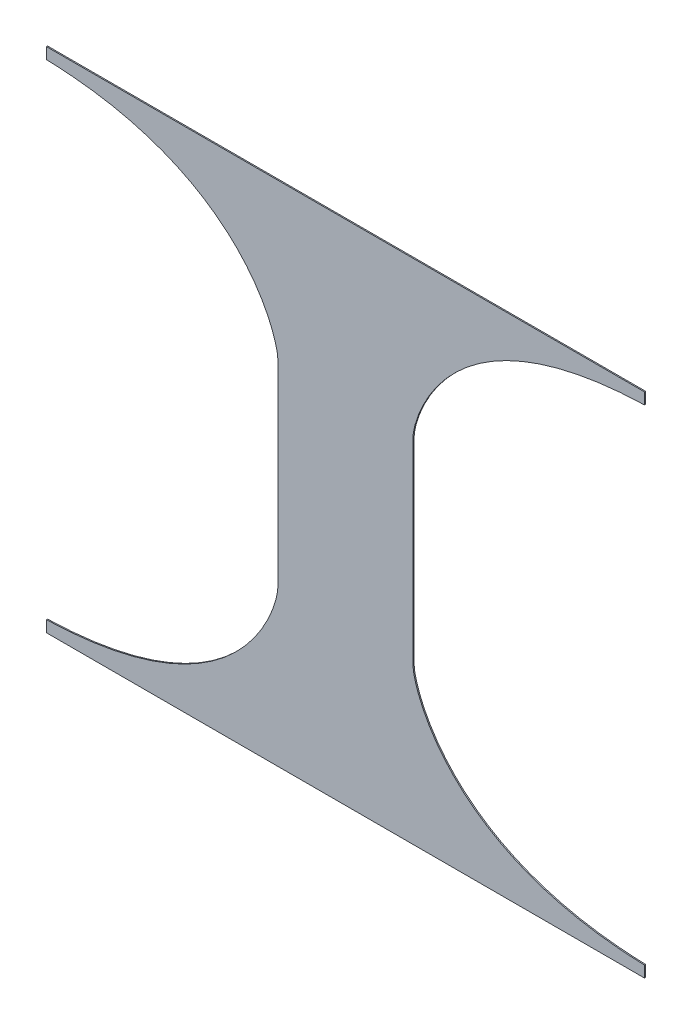
ISO-10303-21;
HEADER;
FILE_DESCRIPTION(('STEP AP214'),'2;1');
FILE_NAME('part.step','',(''),(''),'','','');
FILE_SCHEMA(('AUTOMOTIVE_DESIGN { 1 0 10303 214 1 1 1 1 }'));
ENDSEC;
DATA;
#1=APPLICATION_CONTEXT('core data for automotive mechanical design processes');
#2=APPLICATION_PROTOCOL_DEFINITION('international standard','automotive_design',2000,#1);
#3=PRODUCT_CONTEXT('',#1,'mechanical');
#4=PRODUCT('Part','Part','',(#3));
#5=PRODUCT_RELATED_PRODUCT_CATEGORY('part','',(#4));
#6=PRODUCT_DEFINITION_FORMATION('','',#4);
#7=PRODUCT_DEFINITION_CONTEXT('part definition',#1,'design');
#8=PRODUCT_DEFINITION('design','',#6,#7);
#9=PRODUCT_DEFINITION_SHAPE('','',#8);
#10=(LENGTH_UNIT() NAMED_UNIT(*) SI_UNIT(.MILLI.,.METRE.));
#11=(NAMED_UNIT(*) PLANE_ANGLE_UNIT() SI_UNIT($,.RADIAN.));
#12=(NAMED_UNIT(*) SI_UNIT($,.STERADIAN.) SOLID_ANGLE_UNIT());
#13=UNCERTAINTY_MEASURE_WITH_UNIT(LENGTH_MEASURE(1.E-05),#10,'distance_accuracy_value','');
#14=(GEOMETRIC_REPRESENTATION_CONTEXT(3) GLOBAL_UNCERTAINTY_ASSIGNED_CONTEXT((#13)) GLOBAL_UNIT_ASSIGNED_CONTEXT((#10,
#11,#12)) REPRESENTATION_CONTEXT('',''));
#15=CARTESIAN_POINT('',(0.,0.,0.));
#16=DIRECTION('',(0.,0.,1.));
#17=DIRECTION('',(1.,0.,0.));
#18=AXIS2_PLACEMENT_3D('',#15,#16,#17);
#19=CARTESIAN_POINT('',(673.1,-571.5,1.27));
#20=DIRECTION('',(-1.,0.,0.));
#21=DIRECTION('',(0.,0.,1.));
#22=AXIS2_PLACEMENT_3D('',#19,#20,#21);
#23=PLANE('',#22);
#24=DIRECTION('',(0.,1.,0.));
#25=VECTOR('',#24,1.);
#26=CARTESIAN_POINT('',(673.1,-571.5,1.27));
#27=LINE('',#26,#25);
#28=CARTESIAN_POINT('',(673.1,546.1,1.27));
#29=VERTEX_POINT('',#28);
#30=CARTESIAN_POINT('',(673.1,571.5,1.27));
#31=VERTEX_POINT('',#30);
#32=EDGE_CURVE('E148',#29,#31,#27,.T.);
#33=ORIENTED_EDGE('',*,*,#32,.F.);
#34=DIRECTION('',(0.,0.,1.));
#35=VECTOR('',#34,1.);
#36=CARTESIAN_POINT('',(673.1,546.1,-1.27));
#37=LINE('',#36,#35);
#38=CARTESIAN_POINT('',(673.1,546.1,-1.27));
#39=VERTEX_POINT('',#38);
#40=EDGE_CURVE('E193',#39,#29,#37,.T.);
#41=ORIENTED_EDGE('',*,*,#40,.F.);
#42=DIRECTION('',(0.,1.,0.));
#43=VECTOR('',#42,1.);
#44=CARTESIAN_POINT('',(673.1,-571.5,-1.27));
#45=LINE('',#44,#43);
#46=CARTESIAN_POINT('',(673.1,571.5,-1.27));
#47=VERTEX_POINT('',#46);
#48=EDGE_CURVE('E175',#39,#47,#45,.T.);
#49=ORIENTED_EDGE('',*,*,#48,.T.);
#50=DIRECTION('',(0.,0.,-1.));
#51=VECTOR('',#50,1.);
#52=CARTESIAN_POINT('',(673.1,571.5,1.27));
#53=LINE('',#52,#51);
#54=EDGE_CURVE('E11',#31,#47,#53,.T.);
#55=ORIENTED_EDGE('',*,*,#54,.F.);
#56=EDGE_LOOP('',(#33,#41,#49,#55));
#57=FACE_BOUND('',#56,.T.);
#58=ADVANCED_FACE('F32',(#57),#23,.F.);
#59=CARTESIAN_POINT('',(-673.1,-571.5,1.27));
#60=DIRECTION('',(1.,0.,0.));
#61=DIRECTION('',(0.,0.,-1.));
#62=AXIS2_PLACEMENT_3D('',#59,#60,#61);
#63=PLANE('',#62);
#64=DIRECTION('',(0.,-1.,0.));
#65=VECTOR('',#64,1.);
#66=CARTESIAN_POINT('',(-673.1,-571.5,-1.27));
#67=LINE('',#66,#65);
#68=CARTESIAN_POINT('',(-673.1,571.5,-1.27));
#69=VERTEX_POINT('',#68);
#70=CARTESIAN_POINT('',(-673.1,546.1,-1.27));
#71=VERTEX_POINT('',#70);
#72=EDGE_CURVE('E137',#69,#71,#67,.T.);
#73=ORIENTED_EDGE('',*,*,#72,.T.);
#74=DIRECTION('',(0.,0.,1.));
#75=VECTOR('',#74,1.);
#76=CARTESIAN_POINT('',(-673.1,546.1,-1.27));
#77=LINE('',#76,#75);
#78=CARTESIAN_POINT('',(-673.1,546.1,1.27));
#79=VERTEX_POINT('',#78);
#80=EDGE_CURVE('E121',#71,#79,#77,.T.);
#81=ORIENTED_EDGE('',*,*,#80,.T.);
#82=DIRECTION('',(0.,-1.,0.));
#83=VECTOR('',#82,1.);
#84=CARTESIAN_POINT('',(-673.1,-571.5,1.27));
#85=LINE('',#84,#83);
#86=CARTESIAN_POINT('',(-673.1,571.5,1.27));
#87=VERTEX_POINT('',#86);
#88=EDGE_CURVE('E179',#87,#79,#85,.T.);
#89=ORIENTED_EDGE('',*,*,#88,.F.);
#90=DIRECTION('',(0.,0.,-1.));
#91=VECTOR('',#90,1.);
#92=CARTESIAN_POINT('',(-673.1,571.5,1.27));
#93=LINE('',#92,#91);
#94=EDGE_CURVE('E40',#87,#69,#93,.T.);
#95=ORIENTED_EDGE('',*,*,#94,.T.);
#96=EDGE_LOOP('',(#73,#81,#89,#95));
#97=FACE_BOUND('',#96,.T.);
#98=ADVANCED_FACE('F143',(#97),#63,.F.);
#99=CARTESIAN_POINT('',(673.1,-571.5,-1.27));
#100=VERTEX_POINT('',#99);
#101=CARTESIAN_POINT('',(673.1,-546.1,-1.27));
#102=VERTEX_POINT('',#101);
#103=EDGE_CURVE('E171',#100,#102,#45,.T.);
#104=ORIENTED_EDGE('',*,*,#103,.T.);
#105=DIRECTION('',(0.,0.,1.));
#106=VECTOR('',#105,1.);
#107=CARTESIAN_POINT('',(673.1,-546.1,-1.27));
#108=LINE('',#107,#106);
#109=CARTESIAN_POINT('',(673.1,-546.1,1.27));
#110=VERTEX_POINT('',#109);
#111=EDGE_CURVE('E191',#102,#110,#108,.T.);
#112=ORIENTED_EDGE('',*,*,#111,.T.);
#113=CARTESIAN_POINT('',(673.1,-571.5,1.27));
#114=VERTEX_POINT('',#113);
#115=EDGE_CURVE('E184',#114,#110,#27,.T.);
#116=ORIENTED_EDGE('',*,*,#115,.F.);
#117=DIRECTION('',(0.,0.,-1.));
#118=VECTOR('',#117,1.);
#119=CARTESIAN_POINT('',(673.1,-571.5,1.27));
#120=LINE('',#119,#118);
#121=EDGE_CURVE('E154',#114,#100,#120,.T.);
#122=ORIENTED_EDGE('',*,*,#121,.T.);
#123=EDGE_LOOP('',(#104,#112,#116,#122));
#124=FACE_BOUND('',#123,.T.);
#125=ADVANCED_FACE('F34',(#124),#23,.F.);
#126=CARTESIAN_POINT('',(-673.1,571.5,1.27));
#127=DIRECTION('',(0.,-1.,0.));
#128=DIRECTION('',(0.,0.,-1.));
#129=AXIS2_PLACEMENT_3D('',#126,#127,#128);
#130=PLANE('',#129);
#131=DIRECTION('',(-1.,0.,0.));
#132=VECTOR('',#131,1.);
#133=CARTESIAN_POINT('',(-673.1,571.5,-1.27));
#134=LINE('',#133,#132);
#135=EDGE_CURVE('E150',#47,#69,#134,.T.);
#136=ORIENTED_EDGE('',*,*,#135,.T.);
#137=ORIENTED_EDGE('',*,*,#94,.F.);
#138=DIRECTION('',(-1.,0.,0.));
#139=VECTOR('',#138,1.);
#140=CARTESIAN_POINT('',(-673.1,571.5,1.27));
#141=LINE('',#140,#139);
#142=EDGE_CURVE('E182',#31,#87,#141,.T.);
#143=ORIENTED_EDGE('',*,*,#142,.F.);
#144=ORIENTED_EDGE('',*,*,#54,.T.);
#145=EDGE_LOOP('',(#136,#137,#143,#144));
#146=FACE_BOUND('',#145,.T.);
#147=ADVANCED_FACE('F295',(#146),#130,.F.);
#148=CARTESIAN_POINT('',(-673.1,-546.1,1.27));
#149=VERTEX_POINT('',#148);
#150=CARTESIAN_POINT('',(-673.1,-571.5,1.27));
#151=VERTEX_POINT('',#150);
#152=EDGE_CURVE('E181',#149,#151,#85,.T.);
#153=ORIENTED_EDGE('',*,*,#152,.F.);
#154=DIRECTION('',(0.,0.,1.));
#155=VECTOR('',#154,1.);
#156=CARTESIAN_POINT('',(-673.1,-546.1,-1.27));
#157=LINE('',#156,#155);
#158=CARTESIAN_POINT('',(-673.1,-546.1,-1.27));
#159=VERTEX_POINT('',#158);
#160=EDGE_CURVE('E131',#159,#149,#157,.T.);
#161=ORIENTED_EDGE('',*,*,#160,.F.);
#162=CARTESIAN_POINT('',(-673.1,-571.5,-1.27));
#163=VERTEX_POINT('',#162);
#164=EDGE_CURVE('E146',#159,#163,#67,.T.);
#165=ORIENTED_EDGE('',*,*,#164,.T.);
#166=DIRECTION('',(0.,0.,-1.));
#167=VECTOR('',#166,1.);
#168=CARTESIAN_POINT('',(-673.1,-571.5,1.27));
#169=LINE('',#168,#167);
#170=EDGE_CURVE('E157',#151,#163,#169,.T.);
#171=ORIENTED_EDGE('',*,*,#170,.F.);
#172=EDGE_LOOP('',(#153,#161,#165,#171));
#173=FACE_BOUND('',#172,.T.);
#174=ADVANCED_FACE('F292',(#173),#63,.F.);
#175=CARTESIAN_POINT('',(-673.1,-571.5,1.27));
#176=DIRECTION('',(0.,1.,0.));
#177=DIRECTION('',(0.,0.,1.));
#178=AXIS2_PLACEMENT_3D('',#175,#176,#177);
#179=PLANE('',#178);
#180=DIRECTION('',(1.,0.,0.));
#181=VECTOR('',#180,1.);
#182=CARTESIAN_POINT('',(-673.1,-571.5,-1.27));
#183=LINE('',#182,#181);
#184=EDGE_CURVE('E145',#163,#100,#183,.T.);
#185=ORIENTED_EDGE('',*,*,#184,.T.);
#186=ORIENTED_EDGE('',*,*,#121,.F.);
#187=DIRECTION('',(1.,0.,0.));
#188=VECTOR('',#187,1.);
#189=CARTESIAN_POINT('',(-673.1,-571.5,1.27));
#190=LINE('',#189,#188);
#191=EDGE_CURVE('E158',#151,#114,#190,.T.);
#192=ORIENTED_EDGE('',*,*,#191,.F.);
#193=ORIENTED_EDGE('',*,*,#170,.T.);
#194=EDGE_LOOP('',(#185,#186,#192,#193));
#195=FACE_BOUND('',#194,.T.);
#196=ADVANCED_FACE('F164',(#195),#179,.F.);
#197=CARTESIAN_POINT('',(0.,0.,1.27));
#198=DIRECTION('',(0.,0.,-1.));
#199=DIRECTION('',(-1.,0.,0.));
#200=AXIS2_PLACEMENT_3D('',#197,#198,#199);
#201=PLANE('',#200);
#202=ORIENTED_EDGE('',*,*,#88,.T.);
#203=CARTESIAN_POINT('',(-152.4,224.495117072886,1.27));
#204=CARTESIAN_POINT('',(-152.400000000002,258.704669828593,1.27));
#205=CARTESIAN_POINT('',(-224.053162496935,532.777731837791,1.27));
#206=CARTESIAN_POINT('',(-673.1,546.1,1.27));
#207=B_SPLINE_CURVE_WITH_KNOTS('',3,(#203,#204,#205,#206),.UNSPECIFIED.,.F.,.F.,(4,4),(0.,1.),.UNSPECIFIED.);
#208=CARTESIAN_POINT('',(-152.4,224.495117072886,1.27));
#209=VERTEX_POINT('',#208);
#210=EDGE_CURVE('E126',#209,#79,#207,.T.);
#211=ORIENTED_EDGE('',*,*,#210,.F.);
#212=DIRECTION('',(0.,1.,0.));
#213=VECTOR('',#212,1.);
#214=CARTESIAN_POINT('',(-152.4,224.495117072886,1.27));
#215=LINE('',#214,#213);
#216=CARTESIAN_POINT('',(-152.4,-224.495117072886,1.27));
#217=VERTEX_POINT('',#216);
#218=EDGE_CURVE('E140',#217,#209,#215,.T.);
#219=ORIENTED_EDGE('',*,*,#218,.F.);
#220=CARTESIAN_POINT('',(-673.1,-546.1,1.27));
#221=CARTESIAN_POINT('',(-224.053162496935,-532.777731837791,1.27));
#222=CARTESIAN_POINT('',(-152.400000000002,-258.704669828593,1.27));
#223=CARTESIAN_POINT('',(-152.4,-224.495117072886,1.27));
#224=B_SPLINE_CURVE_WITH_KNOTS('',3,(#220,#221,#222,#223),.UNSPECIFIED.,.F.,.F.,(4,4),(0.,1.),.UNSPECIFIED.);
#225=EDGE_CURVE('E253',#149,#217,#224,.T.);
#226=ORIENTED_EDGE('',*,*,#225,.F.);
#227=ORIENTED_EDGE('',*,*,#152,.T.);
#228=ORIENTED_EDGE('',*,*,#191,.T.);
#229=ORIENTED_EDGE('',*,*,#115,.T.);
#230=CARTESIAN_POINT('',(152.4,-224.495117072886,1.27));
#231=CARTESIAN_POINT('',(152.400000000002,-258.704669828593,1.27));
#232=CARTESIAN_POINT('',(224.053162496935,-532.777731837791,1.27));
#233=CARTESIAN_POINT('',(673.1,-546.1,1.27));
#234=B_SPLINE_CURVE_WITH_KNOTS('',3,(#230,#231,#232,#233),.UNSPECIFIED.,.F.,.F.,(4,4),(0.,1.),.UNSPECIFIED.);
#235=CARTESIAN_POINT('',(152.4,-224.495117072886,1.27));
#236=VERTEX_POINT('',#235);
#237=EDGE_CURVE('E195',#236,#110,#234,.T.);
#238=ORIENTED_EDGE('',*,*,#237,.F.);
#239=DIRECTION('',(0.,-1.,0.));
#240=VECTOR('',#239,1.);
#241=CARTESIAN_POINT('',(152.4,224.495117072886,1.27));
#242=LINE('',#241,#240);
#243=CARTESIAN_POINT('',(152.4,224.495117072886,1.27));
#244=VERTEX_POINT('',#243);
#245=EDGE_CURVE('E200',#244,#236,#242,.T.);
#246=ORIENTED_EDGE('',*,*,#245,.F.);
#247=CARTESIAN_POINT('',(673.1,546.1,1.27));
#248=CARTESIAN_POINT('',(224.053162496935,532.777731837791,1.27));
#249=CARTESIAN_POINT('',(152.400000000002,258.704669828593,1.27));
#250=CARTESIAN_POINT('',(152.4,224.495117072886,1.27));
#251=B_SPLINE_CURVE_WITH_KNOTS('',3,(#247,#248,#249,#250),.UNSPECIFIED.,.F.,.F.,(4,4),(0.,1.),.UNSPECIFIED.);
#252=EDGE_CURVE('E206',#29,#244,#251,.T.);
#253=ORIENTED_EDGE('',*,*,#252,.F.);
#254=ORIENTED_EDGE('',*,*,#32,.T.);
#255=ORIENTED_EDGE('',*,*,#142,.T.);
#256=EDGE_LOOP('',(#202,#211,#219,#226,#227,#228,#229,#238,#246,#253,#254,#255));
#257=FACE_BOUND('',#256,.T.);
#258=ADVANCED_FACE('F237',(#257),#201,.F.);
#259=CARTESIAN_POINT('',(0.,0.,-1.27));
#260=DIRECTION('',(0.,0.,-1.));
#261=DIRECTION('',(-1.,0.,0.));
#262=AXIS2_PLACEMENT_3D('',#259,#260,#261);
#263=PLANE('',#262);
#264=CARTESIAN_POINT('',(-152.4,224.495117072886,-1.27));
#265=CARTESIAN_POINT('',(-152.400000000002,258.704669828593,-1.27));
#266=CARTESIAN_POINT('',(-224.053162496935,532.777731837791,-1.27));
#267=CARTESIAN_POINT('',(-673.1,546.1,-1.27));
#268=B_SPLINE_CURVE_WITH_KNOTS('',3,(#264,#265,#266,#267),.UNSPECIFIED.,.F.,.F.,(4,4),(0.,1.),.UNSPECIFIED.);
#269=CARTESIAN_POINT('',(-152.4,224.495117072886,-1.27));
#270=VERTEX_POINT('',#269);
#271=EDGE_CURVE('E124',#270,#71,#268,.T.);
#272=ORIENTED_EDGE('',*,*,#271,.T.);
#273=ORIENTED_EDGE('',*,*,#72,.F.);
#274=ORIENTED_EDGE('',*,*,#135,.F.);
#275=ORIENTED_EDGE('',*,*,#48,.F.);
#276=CARTESIAN_POINT('',(673.1,546.1,-1.27));
#277=CARTESIAN_POINT('',(224.053162496935,532.777731837791,-1.27));
#278=CARTESIAN_POINT('',(152.400000000002,258.704669828593,-1.27));
#279=CARTESIAN_POINT('',(152.4,224.495117072886,-1.27));
#280=B_SPLINE_CURVE_WITH_KNOTS('',3,(#276,#277,#278,#279),.UNSPECIFIED.,.F.,.F.,(4,4),(0.,1.),.UNSPECIFIED.);
#281=CARTESIAN_POINT('',(152.4,224.495117072886,-1.27));
#282=VERTEX_POINT('',#281);
#283=EDGE_CURVE('E199',#39,#282,#280,.T.);
#284=ORIENTED_EDGE('',*,*,#283,.T.);
#285=DIRECTION('',(0.,-1.,0.));
#286=VECTOR('',#285,1.);
#287=CARTESIAN_POINT('',(152.4,224.495117072886,-1.27));
#288=LINE('',#287,#286);
#289=CARTESIAN_POINT('',(152.4,-224.495117072886,-1.27));
#290=VERTEX_POINT('',#289);
#291=EDGE_CURVE('E218',#282,#290,#288,.T.);
#292=ORIENTED_EDGE('',*,*,#291,.T.);
#293=CARTESIAN_POINT('',(152.4,-224.495117072886,-1.27));
#294=CARTESIAN_POINT('',(152.400000000002,-258.704669828593,-1.27));
#295=CARTESIAN_POINT('',(224.053162496935,-532.777731837791,-1.27));
#296=CARTESIAN_POINT('',(673.1,-546.1,-1.27));
#297=B_SPLINE_CURVE_WITH_KNOTS('',3,(#293,#294,#295,#296),.UNSPECIFIED.,.F.,.F.,(4,4),(0.,1.),.UNSPECIFIED.);
#298=EDGE_CURVE('E55',#290,#102,#297,.T.);
#299=ORIENTED_EDGE('',*,*,#298,.T.);
#300=ORIENTED_EDGE('',*,*,#103,.F.);
#301=ORIENTED_EDGE('',*,*,#184,.F.);
#302=ORIENTED_EDGE('',*,*,#164,.F.);
#303=CARTESIAN_POINT('',(-673.1,-546.1,-1.27));
#304=CARTESIAN_POINT('',(-224.053162496935,-532.777731837791,-1.27));
#305=CARTESIAN_POINT('',(-152.400000000002,-258.704669828593,-1.27));
#306=CARTESIAN_POINT('',(-152.4,-224.495117072886,-1.27));
#307=B_SPLINE_CURVE_WITH_KNOTS('',3,(#303,#304,#305,#306),.UNSPECIFIED.,.F.,.F.,(4,4),(0.,1.),.UNSPECIFIED.);
#308=CARTESIAN_POINT('',(-152.4,-224.495117072886,-1.27));
#309=VERTEX_POINT('',#308);
#310=EDGE_CURVE('E139',#159,#309,#307,.T.);
#311=ORIENTED_EDGE('',*,*,#310,.T.);
#312=DIRECTION('',(0.,1.,0.));
#313=VECTOR('',#312,1.);
#314=CARTESIAN_POINT('',(-152.4,224.495117072886,-1.27));
#315=LINE('',#314,#313);
#316=EDGE_CURVE('E47',#309,#270,#315,.T.);
#317=ORIENTED_EDGE('',*,*,#316,.T.);
#318=EDGE_LOOP('',(#272,#273,#274,#275,#284,#292,#299,#300,#301,#302,#311,#317));
#319=FACE_BOUND('',#318,.T.);
#320=ADVANCED_FACE('F135',(#319),#263,.T.);
#321=DIRECTION('',(0.,0.,1.));
#322=VECTOR('',#321,1.);
#323=SURFACE_OF_LINEAR_EXTRUSION('',#280,#322);
#324=ORIENTED_EDGE('',*,*,#252,.T.);
#325=DIRECTION('',(0.,0.,1.));
#326=VECTOR('',#325,1.);
#327=CARTESIAN_POINT('',(152.4,224.495117072886,-1.27));
#328=LINE('',#327,#326);
#329=EDGE_CURVE('E187',#282,#244,#328,.T.);
#330=ORIENTED_EDGE('',*,*,#329,.F.);
#331=ORIENTED_EDGE('',*,*,#283,.F.);
#332=ORIENTED_EDGE('',*,*,#40,.T.);
#333=EDGE_LOOP('',(#324,#330,#331,#332));
#334=FACE_BOUND('',#333,.T.);
#335=ADVANCED_FACE('F229',(#334),#323,.F.);
#336=DIRECTION('',(0.,0.,1.));
#337=VECTOR('',#336,1.);
#338=SURFACE_OF_LINEAR_EXTRUSION('',#297,#337);
#339=ORIENTED_EDGE('',*,*,#237,.T.);
#340=ORIENTED_EDGE('',*,*,#111,.F.);
#341=ORIENTED_EDGE('',*,*,#298,.F.);
#342=DIRECTION('',(0.,0.,1.));
#343=VECTOR('',#342,1.);
#344=CARTESIAN_POINT('',(152.4,-224.495117072886,-1.27));
#345=LINE('',#344,#343);
#346=EDGE_CURVE('E189',#290,#236,#345,.T.);
#347=ORIENTED_EDGE('',*,*,#346,.T.);
#348=EDGE_LOOP('',(#339,#340,#341,#347));
#349=FACE_BOUND('',#348,.T.);
#350=ADVANCED_FACE('F224',(#349),#338,.F.);
#351=CARTESIAN_POINT('',(152.4,224.495117072886,-1.27));
#352=DIRECTION('',(-1.,0.,0.));
#353=DIRECTION('',(0.,0.,1.));
#354=AXIS2_PLACEMENT_3D('',#351,#352,#353);
#355=PLANE('',#354);
#356=ORIENTED_EDGE('',*,*,#245,.T.);
#357=ORIENTED_EDGE('',*,*,#346,.F.);
#358=ORIENTED_EDGE('',*,*,#291,.F.);
#359=ORIENTED_EDGE('',*,*,#329,.T.);
#360=EDGE_LOOP('',(#356,#357,#358,#359));
#361=FACE_BOUND('',#360,.T.);
#362=ADVANCED_FACE('F228',(#361),#355,.F.);
#363=DIRECTION('',(0.,0.,1.));
#364=VECTOR('',#363,1.);
#365=SURFACE_OF_LINEAR_EXTRUSION('',#268,#364);
#366=ORIENTED_EDGE('',*,*,#210,.T.);
#367=ORIENTED_EDGE('',*,*,#80,.F.);
#368=ORIENTED_EDGE('',*,*,#271,.F.);
#369=DIRECTION('',(0.,0.,1.));
#370=VECTOR('',#369,1.);
#371=CARTESIAN_POINT('',(-152.4,224.495117072886,-1.27));
#372=LINE('',#371,#370);
#373=EDGE_CURVE('E176',#270,#209,#372,.T.);
#374=ORIENTED_EDGE('',*,*,#373,.T.);
#375=EDGE_LOOP('',(#366,#367,#368,#374));
#376=FACE_BOUND('',#375,.T.);
#377=ADVANCED_FACE('F123',(#376),#365,.F.);
#378=CARTESIAN_POINT('',(-152.4,224.495117072886,-1.27));
#379=DIRECTION('',(1.,0.,0.));
#380=DIRECTION('',(0.,0.,-1.));
#381=AXIS2_PLACEMENT_3D('',#378,#379,#380);
#382=PLANE('',#381);
#383=ORIENTED_EDGE('',*,*,#218,.T.);
#384=ORIENTED_EDGE('',*,*,#373,.F.);
#385=ORIENTED_EDGE('',*,*,#316,.F.);
#386=DIRECTION('',(0.,0.,1.));
#387=VECTOR('',#386,1.);
#388=CARTESIAN_POINT('',(-152.4,-224.495117072886,-1.27));
#389=LINE('',#388,#387);
#390=EDGE_CURVE('E248',#309,#217,#389,.T.);
#391=ORIENTED_EDGE('',*,*,#390,.T.);
#392=EDGE_LOOP('',(#383,#384,#385,#391));
#393=FACE_BOUND('',#392,.T.);
#394=ADVANCED_FACE('F280',(#393),#382,.F.);
#395=DIRECTION('',(0.,0.,1.));
#396=VECTOR('',#395,1.);
#397=SURFACE_OF_LINEAR_EXTRUSION('',#307,#396);
#398=ORIENTED_EDGE('',*,*,#225,.T.);
#399=ORIENTED_EDGE('',*,*,#390,.F.);
#400=ORIENTED_EDGE('',*,*,#310,.F.);
#401=ORIENTED_EDGE('',*,*,#160,.T.);
#402=EDGE_LOOP('',(#398,#399,#400,#401));
#403=FACE_BOUND('',#402,.T.);
#404=ADVANCED_FACE('F277',(#403),#397,.F.);
#405=CLOSED_SHELL('',(#58,#98,#125,#147,#174,#196,#258,#320,#335,#350,#362,#377,#394,#404));
#406=MANIFOLD_SOLID_BREP('B2',#405);
#407=ADVANCED_BREP_SHAPE_REPRESENTATION('',(#18,#406),#14);
#408=SHAPE_DEFINITION_REPRESENTATION(#9,#407);
ENDSEC;
END-ISO-10303-21;
